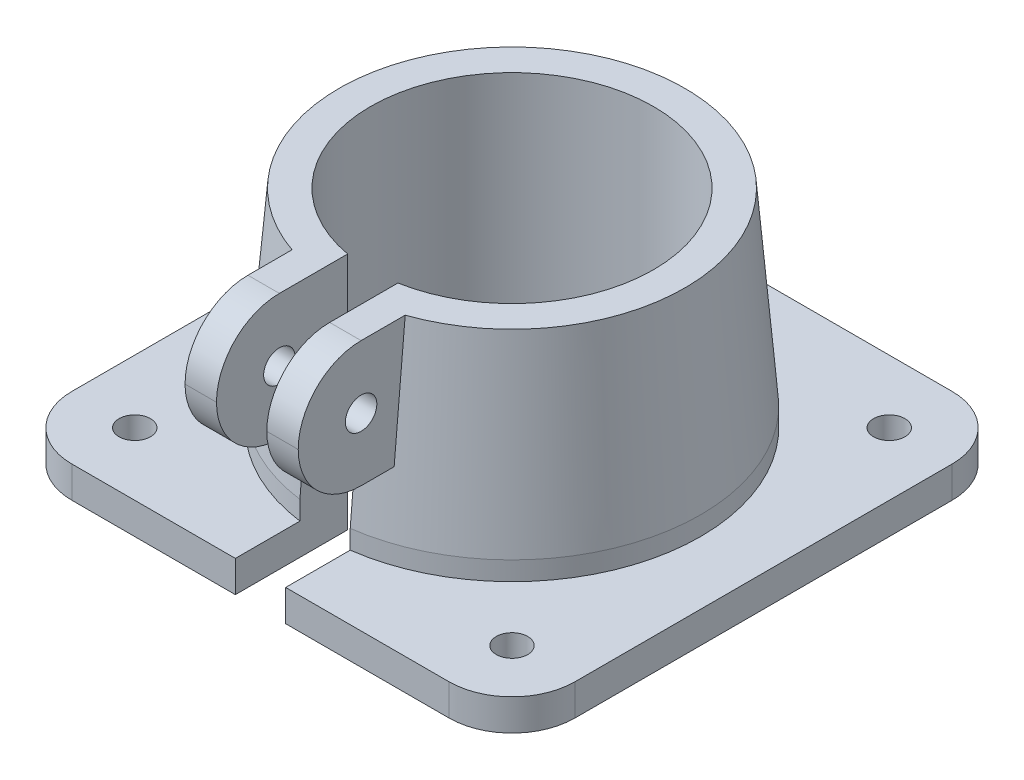
ISO-10303-21;
HEADER;
FILE_DESCRIPTION(('STEP AP214'),'2;1');
FILE_NAME('part.step','',(''),(''),'','','');
FILE_SCHEMA(('AUTOMOTIVE_DESIGN { 1 0 10303 214 1 1 1 1 }'));
ENDSEC;
DATA;
#1=APPLICATION_CONTEXT('core data for automotive mechanical design processes');
#2=APPLICATION_PROTOCOL_DEFINITION('international standard','automotive_design',2000,#1);
#3=PRODUCT_CONTEXT('',#1,'mechanical');
#4=PRODUCT('Part','Part','',(#3));
#5=PRODUCT_RELATED_PRODUCT_CATEGORY('part','',(#4));
#6=PRODUCT_DEFINITION_FORMATION('','',#4);
#7=PRODUCT_DEFINITION_CONTEXT('part definition',#1,'design');
#8=PRODUCT_DEFINITION('design','',#6,#7);
#9=PRODUCT_DEFINITION_SHAPE('','',#8);
#10=(LENGTH_UNIT() NAMED_UNIT(*) SI_UNIT(.MILLI.,.METRE.));
#11=(NAMED_UNIT(*) PLANE_ANGLE_UNIT() SI_UNIT($,.RADIAN.));
#12=(NAMED_UNIT(*) SI_UNIT($,.STERADIAN.) SOLID_ANGLE_UNIT());
#13=UNCERTAINTY_MEASURE_WITH_UNIT(LENGTH_MEASURE(1.E-05),#10,'distance_accuracy_value','');
#14=(GEOMETRIC_REPRESENTATION_CONTEXT(3) GLOBAL_UNCERTAINTY_ASSIGNED_CONTEXT((#13)) GLOBAL_UNIT_ASSIGNED_CONTEXT((#10,
#11,#12)) REPRESENTATION_CONTEXT('',''));
#15=CARTESIAN_POINT('',(0.,0.,0.));
#16=DIRECTION('',(0.,0.,1.));
#17=DIRECTION('',(1.,0.,0.));
#18=AXIS2_PLACEMENT_3D('',#15,#16,#17);
#19=CARTESIAN_POINT('',(0.,0.,0.));
#20=DIRECTION('',(0.,1.,0.));
#21=DIRECTION('',(0.,0.,1.));
#22=AXIS2_PLACEMENT_3D('',#19,#20,#21);
#23=CYLINDRICAL_SURFACE('',#22,22.5);
#24=CARTESIAN_POINT('',(0.,38.,0.));
#25=DIRECTION('',(0.,1.,0.));
#26=DIRECTION('',(0.,0.,1.));
#27=AXIS2_PLACEMENT_3D('',#24,#25,#26);
#28=CIRCLE('',#27,22.5);
#29=CARTESIAN_POINT('',(4.,38.,22.1415898254845));
#30=VERTEX_POINT('',#29);
#31=CARTESIAN_POINT('',(-4.,38.,22.1415898254845));
#32=VERTEX_POINT('',#31);
#33=EDGE_CURVE('E194',#30,#32,#28,.T.);
#34=ORIENTED_EDGE('',*,*,#33,.T.);
#35=DIRECTION('',(0.,1.,0.));
#36=VECTOR('',#35,1.);
#37=CARTESIAN_POINT('',(-4.,0.,22.1415898254845));
#38=LINE('',#37,#36);
#39=CARTESIAN_POINT('',(-4.,0.,22.1415898254845));
#40=VERTEX_POINT('',#39);
#41=EDGE_CURVE('E357',#40,#32,#38,.T.);
#42=ORIENTED_EDGE('',*,*,#41,.F.);
#43=CARTESIAN_POINT('',(0.,0.,0.));
#44=DIRECTION('',(0.,1.,0.));
#45=DIRECTION('',(0.,0.,1.));
#46=AXIS2_PLACEMENT_3D('',#43,#44,#45);
#47=CIRCLE('',#46,22.5);
#48=CARTESIAN_POINT('',(4.,0.,22.1415898254845));
#49=VERTEX_POINT('',#48);
#50=EDGE_CURVE('E210',#49,#40,#47,.T.);
#51=ORIENTED_EDGE('',*,*,#50,.F.);
#52=DIRECTION('',(0.,1.,0.));
#53=VECTOR('',#52,1.);
#54=CARTESIAN_POINT('',(4.,0.,22.1415898254845));
#55=LINE('',#54,#53);
#56=EDGE_CURVE('E206',#49,#30,#55,.T.);
#57=ORIENTED_EDGE('',*,*,#56,.T.);
#58=EDGE_LOOP('',(#34,#42,#51,#57));
#59=FACE_BOUND('',#58,.T.);
#60=ADVANCED_FACE('F40',(#59),#23,.F.);
#61=CARTESIAN_POINT('',(0.,38.,0.));
#62=DIRECTION('',(0.,-1.,0.));
#63=DIRECTION('',(0.,0.,-1.));
#64=AXIS2_PLACEMENT_3D('',#61,#62,#63);
#65=CONICAL_SURFACE('',#64,27.5,0.0831412318884412);
#66=CARTESIAN_POINT('',(9.,73.8331457343378,22.8020068178335));
#67=CARTESIAN_POINT('',(9.,70.0758184808116,23.1386186115361));
#68=CARTESIAN_POINT('',(9.,66.3184031992838,23.4742462495857));
#69=CARTESIAN_POINT('',(9.,58.8034165008538,24.1437469041585));
#70=CARTESIAN_POINT('',(9.,55.04584508396,24.4776199207737));
#71=CARTESIAN_POINT('',(9.,43.7729293566244,25.4769273212473));
#72=CARTESIAN_POINT('',(9.,36.2573801338035,26.1400503631394));
#73=CARTESIAN_POINT('',(9.,20.9795565864973,27.4830753404656));
#74=CARTESIAN_POINT('',(9.,13.2172680091616,28.1628149903969));
#75=CARTESIAN_POINT('',(9.00000000000001,-2.30768196541153,29.518066471215));
#76=CARTESIAN_POINT('',(9.00000000000001,-10.0703433628218,30.1935783001215));
#77=CARTESIAN_POINT('',(9.00000000000001,-17.8331457343378,30.8674604320246));
#78=B_SPLINE_CURVE_WITH_KNOTS('',3,(#66,#67,#68,#69,#70,#71,#72,#73,#74,#75,#76,#77),
.UNSPECIFIED.,.F.,.F.,(4,2,2,2,2,4),(0.,11.3171256263213,22.6342506597728,45.2684903783291,
68.6444710809762,92.0204627325963),.UNSPECIFIED.);
#79=CARTESIAN_POINT('',(9.,38.,25.9855729203726));
#80=VERTEX_POINT('',#79);
#81=CARTESIAN_POINT('',(9.,18.,27.7433675757729));
#82=VERTEX_POINT('',#81);
#83=EDGE_CURVE('E288',#80,#82,#78,.T.);
#84=ORIENTED_EDGE('',*,*,#83,.T.);
#85=CARTESIAN_POINT('',(0.,18.,0.));
#86=DIRECTION('',(0.,1.,0.));
#87=DIRECTION('',(-1.,0.,0.));
#88=AXIS2_PLACEMENT_3D('',#85,#86,#87);
#89=CIRCLE('',#88,29.1666666666667);
#90=CARTESIAN_POINT('',(4.,18.,28.891078976813));
#91=VERTEX_POINT('',#90);
#92=EDGE_CURVE('E285',#82,#91,#89,.F.);
#93=ORIENTED_EDGE('',*,*,#92,.T.);
#94=CARTESIAN_POINT('',(4.,-26.7148496512324,32.6487847033472));
#95=CARTESIAN_POINT('',(4.,-16.6267589983288,31.8018055716135));
#96=CARTESIAN_POINT('',(4.,-6.53870590789701,30.9543784517232));
#97=CARTESIAN_POINT('',(4.,13.6372955511059,29.2582809097083));
#98=CARTESIAN_POINT('',(4.,23.7252439196789,28.4096104876078));
#99=CARTESIAN_POINT('',(4.,40.2968095365762,27.0141760159431));
#100=CARTESIAN_POINT('',(4.,46.780466087042,26.4678787544513));
#101=CARTESIAN_POINT('',(4.,59.7477116331232,25.3744821317756));
#102=CARTESIAN_POINT('',(4.,66.2313006287378,24.8273827705817));
#103=CARTESIAN_POINT('',(4.,72.7148496512324,24.2798098588356));
#104=B_SPLINE_CURVE_WITH_KNOTS('',3,(#94,#95,#96,#97,#98,#99,#100,#101,#102,#103),.UNSPECIFIED.,
.F.,.F.,(4,2,2,2,4),(0.,30.370751129289,60.7415016715958,80.2613937015453,99.7812859739729),.UNSPECIFIED.);
#105=CARTESIAN_POINT('',(4.,8.,29.732137494637));
#106=VERTEX_POINT('',#105);
#107=EDGE_CURVE('E359',#106,#91,#104,.T.);
#108=ORIENTED_EDGE('',*,*,#107,.F.);
#109=CARTESIAN_POINT('',(0.,8.,0.));
#110=DIRECTION('',(0.,1.,0.));
#111=DIRECTION('',(0.,0.,1.));
#112=AXIS2_PLACEMENT_3D('',#109,#110,#111);
#113=CIRCLE('',#112,30.);
#114=CARTESIAN_POINT('',(-4.,8.,29.732137494637));
#115=VERTEX_POINT('',#114);
#116=EDGE_CURVE('E456',#106,#115,#113,.T.);
#117=ORIENTED_EDGE('',*,*,#116,.T.);
#118=CARTESIAN_POINT('',(-4.,-26.7148496512324,32.6487847033472));
#119=CARTESIAN_POINT('',(-4.,-16.6267589983288,31.8018055716135));
#120=CARTESIAN_POINT('',(-4.,-6.53870590789701,30.9543784517232));
#121=CARTESIAN_POINT('',(-4.,13.6372955511059,29.2582809097083));
#122=CARTESIAN_POINT('',(-4.,23.7252439196789,28.4096104876078));
#123=CARTESIAN_POINT('',(-4.,40.2968095365762,27.0141760159431));
#124=CARTESIAN_POINT('',(-4.,46.780466087042,26.4678787544513));
#125=CARTESIAN_POINT('',(-4.,59.7477116331232,25.3744821317756));
#126=CARTESIAN_POINT('',(-4.,66.2313006287378,24.8273827705817));
#127=CARTESIAN_POINT('',(-4.,72.7148496512324,24.2798098588356));
#128=B_SPLINE_CURVE_WITH_KNOTS('',3,(#118,#119,#120,#121,#122,#123,#124,#125,#126,#127),
.UNSPECIFIED.,.F.,.F.,(4,2,2,2,4),(0.,30.370751129289,60.7415016715958,80.2613937015453,
99.7812859739729),.UNSPECIFIED.);
#129=CARTESIAN_POINT('',(-4.,18.,28.891078976813));
#130=VERTEX_POINT('',#129);
#131=EDGE_CURVE('E343',#115,#130,#128,.T.);
#132=ORIENTED_EDGE('',*,*,#131,.T.);
#133=CARTESIAN_POINT('',(0.,18.,0.));
#134=DIRECTION('',(0.,1.,0.));
#135=DIRECTION('',(-1.,0.,0.));
#136=AXIS2_PLACEMENT_3D('',#133,#134,#135);
#137=CIRCLE('',#136,29.1666666666667);
#138=CARTESIAN_POINT('',(-9.,18.,27.7433675757729));
#139=VERTEX_POINT('',#138);
#140=EDGE_CURVE('E337',#130,#139,#137,.F.);
#141=ORIENTED_EDGE('',*,*,#140,.T.);
#142=CARTESIAN_POINT('',(-8.99999999999999,-17.8331457343378,30.8674604320246));
#143=CARTESIAN_POINT('',(-8.99999999999999,-12.903785893805,30.4395694099955));
#144=CARTESIAN_POINT('',(-8.99999999999999,-7.97448497048663,30.0109988361799));
#145=CARTESIAN_POINT('',(-8.99999999999999,1.88398001195845,29.1522826133264));
#146=CARTESIAN_POINT('',(-8.99999999999999,6.81314407107562,28.7221369641796));
#147=CARTESIAN_POINT('',(-9.,16.6713123568272,27.8600549629338));
#148=CARTESIAN_POINT('',(-9.,21.600316583565,27.4281186120181));
#149=CARTESIAN_POINT('',(-9.,31.4581434970061,26.5621806032858));
#150=CARTESIAN_POINT('',(-9.,36.3869661837143,26.1281789455263));
#151=CARTESIAN_POINT('',(-9.,46.7355495926887,25.2144231641757));
#152=CARTESIAN_POINT('',(-9.,52.1552882958359,24.7344195120245));
#153=CARTESIAN_POINT('',(-9.00000000000001,62.9944600270205,23.7709521125825));
#154=CARTESIAN_POINT('',(-9.00000000000001,68.4138930549483,23.2874883640591));
#155=CARTESIAN_POINT('',(-9.00000000000001,73.8331457343378,22.8020068178335));
#156=B_SPLINE_CURVE_WITH_KNOTS('',3,(#142,#143,#144,#145,#146,#147,#148,#149,#150,#151,#152,
#153,#154,#155),.UNSPECIFIED.,.F.,.F.,(4,2,2,2,2,2,4),(0.,14.8436893717152,29.687379769946,
44.5310603606625,59.374740539818,75.6975989256614,92.0204631266317),.UNSPECIFIED.);
#157=CARTESIAN_POINT('',(-9.,38.,25.9855729203726));
#158=VERTEX_POINT('',#157);
#159=EDGE_CURVE('E328',#139,#158,#156,.T.);
#160=ORIENTED_EDGE('',*,*,#159,.T.);
#161=CARTESIAN_POINT('',(0.,38.,0.));
#162=DIRECTION('',(0.,1.,0.));
#163=DIRECTION('',(0.,0.,1.));
#164=AXIS2_PLACEMENT_3D('',#161,#162,#163);
#165=CIRCLE('',#164,27.5);
#166=EDGE_CURVE('E205',#80,#158,#165,.T.);
#167=ORIENTED_EDGE('',*,*,#166,.F.);
#168=EDGE_LOOP('',(#84,#93,#108,#117,#132,#141,#160,#167));
#169=FACE_BOUND('',#168,.T.);
#170=ADVANCED_FACE('F299',(#169),#65,.T.);
#171=CARTESIAN_POINT('',(30.,5.,40.));
#172=DIRECTION('',(0.,0.,-1.));
#173=DIRECTION('',(-1.,0.,0.));
#174=AXIS2_PLACEMENT_3D('',#171,#172,#173);
#175=PLANE('',#174);
#176=DIRECTION('',(0.,-1.,0.));
#177=VECTOR('',#176,1.);
#178=CARTESIAN_POINT('',(-4.,38.,40.));
#179=LINE('',#178,#177);
#180=CARTESIAN_POINT('',(-4.,5.,40.));
#181=VERTEX_POINT('',#180);
#182=CARTESIAN_POINT('',(-4.,0.,40.));
#183=VERTEX_POINT('',#182);
#184=EDGE_CURVE('E336',#181,#183,#179,.T.);
#185=ORIENTED_EDGE('',*,*,#184,.F.);
#186=DIRECTION('',(1.,0.,0.));
#187=VECTOR('',#186,1.);
#188=CARTESIAN_POINT('',(30.,5.,40.));
#189=LINE('',#188,#187);
#190=CARTESIAN_POINT('',(-30.,5.,40.));
#191=VERTEX_POINT('',#190);
#192=EDGE_CURVE('E486',#191,#181,#189,.T.);
#193=ORIENTED_EDGE('',*,*,#192,.F.);
#194=DIRECTION('',(0.,-1.,0.));
#195=VECTOR('',#194,1.);
#196=CARTESIAN_POINT('',(-30.,5.,40.));
#197=LINE('',#196,#195);
#198=CARTESIAN_POINT('',(-30.,0.,40.));
#199=VERTEX_POINT('',#198);
#200=EDGE_CURVE('E506',#191,#199,#197,.T.);
#201=ORIENTED_EDGE('',*,*,#200,.T.);
#202=DIRECTION('',(1.,0.,0.));
#203=VECTOR('',#202,1.);
#204=CARTESIAN_POINT('',(30.,0.,40.));
#205=LINE('',#204,#203);
#206=EDGE_CURVE('E473',#199,#183,#205,.T.);
#207=ORIENTED_EDGE('',*,*,#206,.T.);
#208=EDGE_LOOP('',(#185,#193,#201,#207));
#209=FACE_BOUND('',#208,.T.);
#210=ADVANCED_FACE('F379',(#209),#175,.F.);
#211=CARTESIAN_POINT('',(30.,5.,30.));
#212=DIRECTION('',(0.,-1.,0.));
#213=DIRECTION('',(0.,0.,-1.));
#214=AXIS2_PLACEMENT_3D('',#211,#212,#213);
#215=CYLINDRICAL_SURFACE('',#214,10.);
#216=CARTESIAN_POINT('',(30.,0.,30.));
#217=DIRECTION('',(0.,1.,0.));
#218=DIRECTION('',(0.,0.,1.));
#219=AXIS2_PLACEMENT_3D('',#216,#217,#218);
#220=CIRCLE('',#219,10.);
#221=CARTESIAN_POINT('',(30.,0.,40.));
#222=VERTEX_POINT('',#221);
#223=CARTESIAN_POINT('',(40.,0.,30.));
#224=VERTEX_POINT('',#223);
#225=EDGE_CURVE('E458',#222,#224,#220,.T.);
#226=ORIENTED_EDGE('',*,*,#225,.T.);
#227=DIRECTION('',(0.,-1.,0.));
#228=VECTOR('',#227,1.);
#229=CARTESIAN_POINT('',(40.,5.,30.));
#230=LINE('',#229,#228);
#231=CARTESIAN_POINT('',(40.,5.,30.));
#232=VERTEX_POINT('',#231);
#233=EDGE_CURVE('E468',#232,#224,#230,.T.);
#234=ORIENTED_EDGE('',*,*,#233,.F.);
#235=CARTESIAN_POINT('',(30.,5.,30.));
#236=DIRECTION('',(0.,1.,0.));
#237=DIRECTION('',(0.,0.,1.));
#238=AXIS2_PLACEMENT_3D('',#235,#236,#237);
#239=CIRCLE('',#238,10.);
#240=CARTESIAN_POINT('',(30.,5.,40.));
#241=VERTEX_POINT('',#240);
#242=EDGE_CURVE('E469',#241,#232,#239,.T.);
#243=ORIENTED_EDGE('',*,*,#242,.F.);
#244=DIRECTION('',(0.,-1.,0.));
#245=VECTOR('',#244,1.);
#246=CARTESIAN_POINT('',(30.,5.,40.));
#247=LINE('',#246,#245);
#248=EDGE_CURVE('E488',#241,#222,#247,.T.);
#249=ORIENTED_EDGE('',*,*,#248,.T.);
#250=EDGE_LOOP('',(#226,#234,#243,#249));
#251=FACE_BOUND('',#250,.T.);
#252=ADVANCED_FACE('F422',(#251),#215,.T.);
#253=CARTESIAN_POINT('',(40.,5.,30.));
#254=DIRECTION('',(-1.,0.,0.));
#255=DIRECTION('',(0.,0.,1.));
#256=AXIS2_PLACEMENT_3D('',#253,#254,#255);
#257=PLANE('',#256);
#258=DIRECTION('',(0.,0.,-1.));
#259=VECTOR('',#258,1.);
#260=CARTESIAN_POINT('',(40.,0.,30.));
#261=LINE('',#260,#259);
#262=CARTESIAN_POINT('',(40.,0.,-30.));
#263=VERTEX_POINT('',#262);
#264=EDGE_CURVE('E461',#224,#263,#261,.T.);
#265=ORIENTED_EDGE('',*,*,#264,.T.);
#266=DIRECTION('',(0.,-1.,0.));
#267=VECTOR('',#266,1.);
#268=CARTESIAN_POINT('',(40.,5.,-30.));
#269=LINE('',#268,#267);
#270=CARTESIAN_POINT('',(40.,5.,-30.));
#271=VERTEX_POINT('',#270);
#272=EDGE_CURVE('E521',#271,#263,#269,.T.);
#273=ORIENTED_EDGE('',*,*,#272,.F.);
#274=DIRECTION('',(0.,0.,-1.));
#275=VECTOR('',#274,1.);
#276=CARTESIAN_POINT('',(40.,5.,30.));
#277=LINE('',#276,#275);
#278=EDGE_CURVE('E472',#232,#271,#277,.T.);
#279=ORIENTED_EDGE('',*,*,#278,.F.);
#280=ORIENTED_EDGE('',*,*,#233,.T.);
#281=EDGE_LOOP('',(#265,#273,#279,#280));
#282=FACE_BOUND('',#281,.T.);
#283=ADVANCED_FACE('F418',(#282),#257,.F.);
#284=CARTESIAN_POINT('',(30.,5.,-30.));
#285=DIRECTION('',(0.,-1.,0.));
#286=DIRECTION('',(0.,0.,-1.));
#287=AXIS2_PLACEMENT_3D('',#284,#285,#286);
#288=CYLINDRICAL_SURFACE('',#287,10.);
#289=CARTESIAN_POINT('',(30.,0.,-30.));
#290=DIRECTION('',(0.,1.,0.));
#291=DIRECTION('',(0.,0.,1.));
#292=AXIS2_PLACEMENT_3D('',#289,#290,#291);
#293=CIRCLE('',#292,10.);
#294=CARTESIAN_POINT('',(30.,0.,-40.));
#295=VERTEX_POINT('',#294);
#296=EDGE_CURVE('E491',#263,#295,#293,.T.);
#297=ORIENTED_EDGE('',*,*,#296,.T.);
#298=DIRECTION('',(0.,-1.,0.));
#299=VECTOR('',#298,1.);
#300=CARTESIAN_POINT('',(30.,5.,-40.));
#301=LINE('',#300,#299);
#302=CARTESIAN_POINT('',(30.,5.,-40.));
#303=VERTEX_POINT('',#302);
#304=EDGE_CURVE('E518',#303,#295,#301,.T.);
#305=ORIENTED_EDGE('',*,*,#304,.F.);
#306=CARTESIAN_POINT('',(30.,5.,-30.));
#307=DIRECTION('',(0.,1.,0.));
#308=DIRECTION('',(0.,0.,1.));
#309=AXIS2_PLACEMENT_3D('',#306,#307,#308);
#310=CIRCLE('',#309,10.);
#311=EDGE_CURVE('E475',#271,#303,#310,.T.);
#312=ORIENTED_EDGE('',*,*,#311,.F.);
#313=ORIENTED_EDGE('',*,*,#272,.T.);
#314=EDGE_LOOP('',(#297,#305,#312,#313));
#315=FACE_BOUND('',#314,.T.);
#316=ADVANCED_FACE('F414',(#315),#288,.T.);
#317=CARTESIAN_POINT('',(30.,5.,-40.));
#318=DIRECTION('',(0.,0.,1.));
#319=DIRECTION('',(1.,0.,0.));
#320=AXIS2_PLACEMENT_3D('',#317,#318,#319);
#321=PLANE('',#320);
#322=DIRECTION('',(-1.,0.,0.));
#323=VECTOR('',#322,1.);
#324=CARTESIAN_POINT('',(30.,0.,-40.));
#325=LINE('',#324,#323);
#326=CARTESIAN_POINT('',(-30.,0.,-40.));
#327=VERTEX_POINT('',#326);
#328=EDGE_CURVE('E493',#295,#327,#325,.T.);
#329=ORIENTED_EDGE('',*,*,#328,.T.);
#330=DIRECTION('',(0.,-1.,0.));
#331=VECTOR('',#330,1.);
#332=CARTESIAN_POINT('',(-30.,5.,-40.));
#333=LINE('',#332,#331);
#334=CARTESIAN_POINT('',(-30.,5.,-40.));
#335=VERTEX_POINT('',#334);
#336=EDGE_CURVE('E515',#335,#327,#333,.T.);
#337=ORIENTED_EDGE('',*,*,#336,.F.);
#338=DIRECTION('',(-1.,0.,0.));
#339=VECTOR('',#338,1.);
#340=CARTESIAN_POINT('',(30.,5.,-40.));
#341=LINE('',#340,#339);
#342=EDGE_CURVE('E477',#303,#335,#341,.T.);
#343=ORIENTED_EDGE('',*,*,#342,.F.);
#344=ORIENTED_EDGE('',*,*,#304,.T.);
#345=EDGE_LOOP('',(#329,#337,#343,#344));
#346=FACE_BOUND('',#345,.T.);
#347=ADVANCED_FACE('F410',(#346),#321,.F.);
#348=CARTESIAN_POINT('',(-30.,5.,-30.));
#349=DIRECTION('',(0.,-1.,0.));
#350=DIRECTION('',(0.,0.,-1.));
#351=AXIS2_PLACEMENT_3D('',#348,#349,#350);
#352=CYLINDRICAL_SURFACE('',#351,10.);
#353=CARTESIAN_POINT('',(-30.,0.,-30.));
#354=DIRECTION('',(0.,1.,0.));
#355=DIRECTION('',(0.,0.,-1.));
#356=AXIS2_PLACEMENT_3D('',#353,#354,#355);
#357=CIRCLE('',#356,10.);
#358=CARTESIAN_POINT('',(-40.,0.,-30.));
#359=VERTEX_POINT('',#358);
#360=EDGE_CURVE('E495',#327,#359,#357,.T.);
#361=ORIENTED_EDGE('',*,*,#360,.T.);
#362=DIRECTION('',(0.,-1.,0.));
#363=VECTOR('',#362,1.);
#364=CARTESIAN_POINT('',(-40.,5.,-30.));
#365=LINE('',#364,#363);
#366=CARTESIAN_POINT('',(-40.,5.,-30.));
#367=VERTEX_POINT('',#366);
#368=EDGE_CURVE('E512',#367,#359,#365,.T.);
#369=ORIENTED_EDGE('',*,*,#368,.F.);
#370=CARTESIAN_POINT('',(-30.,5.,-30.));
#371=DIRECTION('',(0.,1.,0.));
#372=DIRECTION('',(0.,0.,-1.));
#373=AXIS2_PLACEMENT_3D('',#370,#371,#372);
#374=CIRCLE('',#373,10.);
#375=EDGE_CURVE('E479',#335,#367,#374,.T.);
#376=ORIENTED_EDGE('',*,*,#375,.F.);
#377=ORIENTED_EDGE('',*,*,#336,.T.);
#378=EDGE_LOOP('',(#361,#369,#376,#377));
#379=FACE_BOUND('',#378,.T.);
#380=ADVANCED_FACE('F406',(#379),#352,.T.);
#381=CARTESIAN_POINT('',(-40.,5.,30.));
#382=DIRECTION('',(1.,0.,0.));
#383=DIRECTION('',(0.,0.,-1.));
#384=AXIS2_PLACEMENT_3D('',#381,#382,#383);
#385=PLANE('',#384);
#386=DIRECTION('',(0.,0.,1.));
#387=VECTOR('',#386,1.);
#388=CARTESIAN_POINT('',(-40.,0.,30.));
#389=LINE('',#388,#387);
#390=CARTESIAN_POINT('',(-40.,0.,30.));
#391=VERTEX_POINT('',#390);
#392=EDGE_CURVE('E497',#359,#391,#389,.T.);
#393=ORIENTED_EDGE('',*,*,#392,.T.);
#394=DIRECTION('',(0.,-1.,0.));
#395=VECTOR('',#394,1.);
#396=CARTESIAN_POINT('',(-40.,5.,30.));
#397=LINE('',#396,#395);
#398=CARTESIAN_POINT('',(-40.,5.,30.));
#399=VERTEX_POINT('',#398);
#400=EDGE_CURVE('E509',#399,#391,#397,.T.);
#401=ORIENTED_EDGE('',*,*,#400,.F.);
#402=DIRECTION('',(0.,0.,1.));
#403=VECTOR('',#402,1.);
#404=CARTESIAN_POINT('',(-40.,5.,30.));
#405=LINE('',#404,#403);
#406=EDGE_CURVE('E481',#367,#399,#405,.T.);
#407=ORIENTED_EDGE('',*,*,#406,.F.);
#408=ORIENTED_EDGE('',*,*,#368,.T.);
#409=EDGE_LOOP('',(#393,#401,#407,#408));
#410=FACE_BOUND('',#409,.T.);
#411=ADVANCED_FACE('F402',(#410),#385,.F.);
#412=CARTESIAN_POINT('',(-30.,5.,30.));
#413=DIRECTION('',(0.,-1.,0.));
#414=DIRECTION('',(0.,0.,-1.));
#415=AXIS2_PLACEMENT_3D('',#412,#413,#414);
#416=CYLINDRICAL_SURFACE('',#415,10.);
#417=CARTESIAN_POINT('',(-30.,0.,30.));
#418=DIRECTION('',(0.,1.,0.));
#419=DIRECTION('',(0.,0.,-1.));
#420=AXIS2_PLACEMENT_3D('',#417,#418,#419);
#421=CIRCLE('',#420,10.);
#422=EDGE_CURVE('E499',#391,#199,#421,.T.);
#423=ORIENTED_EDGE('',*,*,#422,.T.);
#424=ORIENTED_EDGE('',*,*,#200,.F.);
#425=CARTESIAN_POINT('',(-30.,5.,30.));
#426=DIRECTION('',(0.,1.,0.));
#427=DIRECTION('',(0.,0.,-1.));
#428=AXIS2_PLACEMENT_3D('',#425,#426,#427);
#429=CIRCLE('',#428,10.);
#430=EDGE_CURVE('E483',#399,#191,#429,.T.);
#431=ORIENTED_EDGE('',*,*,#430,.F.);
#432=ORIENTED_EDGE('',*,*,#400,.T.);
#433=EDGE_LOOP('',(#423,#424,#431,#432));
#434=FACE_BOUND('',#433,.T.);
#435=ADVANCED_FACE('F398',(#434),#416,.T.);
#436=CARTESIAN_POINT('',(4.,5.,40.));
#437=VERTEX_POINT('',#436);
#438=EDGE_CURVE('E485',#437,#241,#189,.T.);
#439=ORIENTED_EDGE('',*,*,#438,.F.);
#440=DIRECTION('',(0.,-1.,0.));
#441=VECTOR('',#440,1.);
#442=CARTESIAN_POINT('',(4.,38.,40.));
#443=LINE('',#442,#441);
#444=CARTESIAN_POINT('',(4.,0.,40.));
#445=VERTEX_POINT('',#444);
#446=EDGE_CURVE('E340',#437,#445,#443,.T.);
#447=ORIENTED_EDGE('',*,*,#446,.T.);
#448=EDGE_CURVE('E501',#445,#222,#205,.T.);
#449=ORIENTED_EDGE('',*,*,#448,.T.);
#450=ORIENTED_EDGE('',*,*,#248,.F.);
#451=EDGE_LOOP('',(#439,#447,#449,#450));
#452=FACE_BOUND('',#451,.T.);
#453=ADVANCED_FACE('F392',(#452),#175,.F.);
#454=CARTESIAN_POINT('',(30.,5.,30.));
#455=DIRECTION('',(0.,1.,0.));
#456=DIRECTION('',(0.,0.,1.));
#457=AXIS2_PLACEMENT_3D('',#454,#455,#456);
#458=PLANE('',#457);
#459=CARTESIAN_POINT('',(-30.,5.,30.));
#460=DIRECTION('',(0.,1.,0.));
#461=DIRECTION('',(0.,0.,1.));
#462=AXIS2_PLACEMENT_3D('',#459,#460,#461);
#463=CIRCLE('',#462,2.5);
#464=CARTESIAN_POINT('',(-30.,5.,32.5));
#465=VERTEX_POINT('',#464);
#466=EDGE_CURVE('E744',#465,#465,#463,.T.);
#467=ORIENTED_EDGE('',*,*,#466,.F.);
#468=EDGE_LOOP('',(#467));
#469=FACE_BOUND('',#468,.T.);
#470=CARTESIAN_POINT('',(30.,5.,-30.));
#471=DIRECTION('',(0.,1.,0.));
#472=DIRECTION('',(0.,0.,1.));
#473=AXIS2_PLACEMENT_3D('',#470,#471,#472);
#474=CIRCLE('',#473,2.5);
#475=CARTESIAN_POINT('',(30.,5.,-27.5));
#476=VERTEX_POINT('',#475);
#477=EDGE_CURVE('E745',#476,#476,#474,.T.);
#478=ORIENTED_EDGE('',*,*,#477,.F.);
#479=EDGE_LOOP('',(#478));
#480=FACE_BOUND('',#479,.T.);
#481=CARTESIAN_POINT('',(-30.,5.,-30.));
#482=DIRECTION('',(0.,1.,0.));
#483=DIRECTION('',(0.,0.,1.));
#484=AXIS2_PLACEMENT_3D('',#481,#482,#483);
#485=CIRCLE('',#484,2.5);
#486=CARTESIAN_POINT('',(-30.,5.,-27.5));
#487=VERTEX_POINT('',#486);
#488=EDGE_CURVE('E749',#487,#487,#485,.T.);
#489=ORIENTED_EDGE('',*,*,#488,.F.);
#490=EDGE_LOOP('',(#489));
#491=FACE_BOUND('',#490,.T.);
#492=CARTESIAN_POINT('',(30.,5.,30.));
#493=DIRECTION('',(0.,1.,0.));
#494=DIRECTION('',(0.,0.,1.));
#495=AXIS2_PLACEMENT_3D('',#492,#493,#494);
#496=CIRCLE('',#495,2.5);
#497=CARTESIAN_POINT('',(30.,5.,32.5));
#498=VERTEX_POINT('',#497);
#499=EDGE_CURVE('E255',#498,#498,#496,.T.);
#500=ORIENTED_EDGE('',*,*,#499,.F.);
#501=EDGE_LOOP('',(#500));
#502=FACE_BOUND('',#501,.T.);
#503=DIRECTION('',(0.,0.,-1.));
#504=VECTOR('',#503,1.);
#505=CARTESIAN_POINT('',(4.,5.,30.));
#506=LINE('',#505,#504);
#507=CARTESIAN_POINT('',(4.,5.,29.732137494637));
#508=VERTEX_POINT('',#507);
#509=EDGE_CURVE('E544',#437,#508,#506,.T.);
#510=ORIENTED_EDGE('',*,*,#509,.F.);
#511=ORIENTED_EDGE('',*,*,#438,.T.);
#512=ORIENTED_EDGE('',*,*,#242,.T.);
#513=ORIENTED_EDGE('',*,*,#278,.T.);
#514=ORIENTED_EDGE('',*,*,#311,.T.);
#515=ORIENTED_EDGE('',*,*,#342,.T.);
#516=ORIENTED_EDGE('',*,*,#375,.T.);
#517=ORIENTED_EDGE('',*,*,#406,.T.);
#518=ORIENTED_EDGE('',*,*,#430,.T.);
#519=ORIENTED_EDGE('',*,*,#192,.T.);
#520=DIRECTION('',(0.,0.,-1.));
#521=VECTOR('',#520,1.);
#522=CARTESIAN_POINT('',(-4.,5.,30.));
#523=LINE('',#522,#521);
#524=CARTESIAN_POINT('',(-4.,5.,29.732137494637));
#525=VERTEX_POINT('',#524);
#526=EDGE_CURVE('E352',#181,#525,#523,.T.);
#527=ORIENTED_EDGE('',*,*,#526,.T.);
#528=CARTESIAN_POINT('',(0.,5.,0.));
#529=DIRECTION('',(0.,1.,0.));
#530=DIRECTION('',(0.,0.,1.));
#531=AXIS2_PLACEMENT_3D('',#528,#529,#530);
#532=CIRCLE('',#531,30.);
#533=EDGE_CURVE('E222',#508,#525,#532,.T.);
#534=ORIENTED_EDGE('',*,*,#533,.F.);
#535=EDGE_LOOP('',(#510,#511,#512,#513,#514,#515,#516,#517,#518,#519,#527,#534));
#536=FACE_BOUND('',#535,.T.);
#537=ADVANCED_FACE('F389',(#469,#480,#491,#502,#536),#458,.T.);
#538=CARTESIAN_POINT('',(30.,0.,30.));
#539=DIRECTION('',(0.,1.,0.));
#540=DIRECTION('',(0.,0.,1.));
#541=AXIS2_PLACEMENT_3D('',#538,#539,#540);
#542=PLANE('',#541);
#543=CARTESIAN_POINT('',(-30.,0.,30.));
#544=DIRECTION('',(0.,1.,0.));
#545=DIRECTION('',(0.,0.,1.));
#546=AXIS2_PLACEMENT_3D('',#543,#544,#545);
#547=CIRCLE('',#546,2.5);
#548=CARTESIAN_POINT('',(-30.,0.,32.5));
#549=VERTEX_POINT('',#548);
#550=EDGE_CURVE('E44',#549,#549,#547,.T.);
#551=ORIENTED_EDGE('',*,*,#550,.T.);
#552=EDGE_LOOP('',(#551));
#553=FACE_BOUND('',#552,.T.);
#554=CARTESIAN_POINT('',(30.,0.,-30.));
#555=DIRECTION('',(0.,1.,0.));
#556=DIRECTION('',(0.,0.,1.));
#557=AXIS2_PLACEMENT_3D('',#554,#555,#556);
#558=CIRCLE('',#557,2.5);
#559=CARTESIAN_POINT('',(30.,0.,-27.5));
#560=VERTEX_POINT('',#559);
#561=EDGE_CURVE('E257',#560,#560,#558,.T.);
#562=ORIENTED_EDGE('',*,*,#561,.T.);
#563=EDGE_LOOP('',(#562));
#564=FACE_BOUND('',#563,.T.);
#565=CARTESIAN_POINT('',(-30.,0.,-30.));
#566=DIRECTION('',(0.,1.,0.));
#567=DIRECTION('',(0.,0.,1.));
#568=AXIS2_PLACEMENT_3D('',#565,#566,#567);
#569=CIRCLE('',#568,2.5);
#570=CARTESIAN_POINT('',(-30.,0.,-27.5));
#571=VERTEX_POINT('',#570);
#572=EDGE_CURVE('E254',#571,#571,#569,.T.);
#573=ORIENTED_EDGE('',*,*,#572,.T.);
#574=EDGE_LOOP('',(#573));
#575=FACE_BOUND('',#574,.T.);
#576=CARTESIAN_POINT('',(30.,0.,30.));
#577=DIRECTION('',(0.,1.,0.));
#578=DIRECTION('',(0.,0.,1.));
#579=AXIS2_PLACEMENT_3D('',#576,#577,#578);
#580=CIRCLE('',#579,2.5);
#581=CARTESIAN_POINT('',(30.,0.,32.5));
#582=VERTEX_POINT('',#581);
#583=EDGE_CURVE('E251',#582,#582,#580,.T.);
#584=ORIENTED_EDGE('',*,*,#583,.T.);
#585=EDGE_LOOP('',(#584));
#586=FACE_BOUND('',#585,.T.);
#587=ORIENTED_EDGE('',*,*,#448,.F.);
#588=DIRECTION('',(0.,0.,-1.));
#589=VECTOR('',#588,1.);
#590=CARTESIAN_POINT('',(4.,0.,30.));
#591=LINE('',#590,#589);
#592=EDGE_CURVE('E213',#445,#49,#591,.T.);
#593=ORIENTED_EDGE('',*,*,#592,.T.);
#594=ORIENTED_EDGE('',*,*,#50,.T.);
#595=DIRECTION('',(0.,0.,-1.));
#596=VECTOR('',#595,1.);
#597=CARTESIAN_POINT('',(-4.,0.,30.));
#598=LINE('',#597,#596);
#599=EDGE_CURVE('E355',#183,#40,#598,.T.);
#600=ORIENTED_EDGE('',*,*,#599,.F.);
#601=ORIENTED_EDGE('',*,*,#206,.F.);
#602=ORIENTED_EDGE('',*,*,#422,.F.);
#603=ORIENTED_EDGE('',*,*,#392,.F.);
#604=ORIENTED_EDGE('',*,*,#360,.F.);
#605=ORIENTED_EDGE('',*,*,#328,.F.);
#606=ORIENTED_EDGE('',*,*,#296,.F.);
#607=ORIENTED_EDGE('',*,*,#264,.F.);
#608=ORIENTED_EDGE('',*,*,#225,.F.);
#609=EDGE_LOOP('',(#587,#593,#594,#600,#601,#602,#603,#604,#605,#606,#607,#608));
#610=FACE_BOUND('',#609,.T.);
#611=ADVANCED_FACE('F387',(#553,#564,#575,#586,#610),#542,.F.);
#612=CARTESIAN_POINT('',(0.,8.,0.));
#613=DIRECTION('',(0.,-1.,0.));
#614=DIRECTION('',(0.,0.,-1.));
#615=AXIS2_PLACEMENT_3D('',#612,#613,#614);
#616=CYLINDRICAL_SURFACE('',#615,30.);
#617=ORIENTED_EDGE('',*,*,#116,.F.);
#618=DIRECTION('',(0.,-1.,0.));
#619=VECTOR('',#618,1.);
#620=CARTESIAN_POINT('',(4.,8.,29.732137494637));
#621=LINE('',#620,#619);
#622=EDGE_CURVE('E366',#106,#508,#621,.T.);
#623=ORIENTED_EDGE('',*,*,#622,.T.);
#624=ORIENTED_EDGE('',*,*,#533,.T.);
#625=DIRECTION('',(0.,-1.,0.));
#626=VECTOR('',#625,1.);
#627=CARTESIAN_POINT('',(-4.,8.,29.732137494637));
#628=LINE('',#627,#626);
#629=EDGE_CURVE('E350',#115,#525,#628,.T.);
#630=ORIENTED_EDGE('',*,*,#629,.F.);
#631=EDGE_LOOP('',(#617,#623,#624,#630));
#632=FACE_BOUND('',#631,.T.);
#633=ADVANCED_FACE('F384',(#632),#616,.T.);
#634=CARTESIAN_POINT('',(0.,38.,0.));
#635=DIRECTION('',(0.,1.,0.));
#636=DIRECTION('',(0.,0.,1.));
#637=AXIS2_PLACEMENT_3D('',#634,#635,#636);
#638=PLANE('',#637);
#639=ORIENTED_EDGE('',*,*,#33,.F.);
#640=DIRECTION('',(0.,0.,-1.));
#641=VECTOR('',#640,1.);
#642=CARTESIAN_POINT('',(4.,38.,0.));
#643=LINE('',#642,#641);
#644=CARTESIAN_POINT('',(4.,38.,33.));
#645=VERTEX_POINT('',#644);
#646=EDGE_CURVE('E198',#645,#30,#643,.T.);
#647=ORIENTED_EDGE('',*,*,#646,.F.);
#648=DIRECTION('',(-1.,0.,0.));
#649=VECTOR('',#648,1.);
#650=CARTESIAN_POINT('',(0.,38.,33.));
#651=LINE('',#650,#649);
#652=CARTESIAN_POINT('',(9.,38.,33.));
#653=VERTEX_POINT('',#652);
#654=EDGE_CURVE('E12',#645,#653,#651,.F.);
#655=ORIENTED_EDGE('',*,*,#654,.T.);
#656=DIRECTION('',(0.,0.,-1.));
#657=VECTOR('',#656,1.);
#658=CARTESIAN_POINT('',(9.,38.,43.));
#659=LINE('',#658,#657);
#660=EDGE_CURVE('E246',#653,#80,#659,.T.);
#661=ORIENTED_EDGE('',*,*,#660,.T.);
#662=ORIENTED_EDGE('',*,*,#166,.T.);
#663=DIRECTION('',(0.,0.,-1.));
#664=VECTOR('',#663,1.);
#665=CARTESIAN_POINT('',(-9.,38.,43.));
#666=LINE('',#665,#664);
#667=CARTESIAN_POINT('',(-9.,38.,33.));
#668=VERTEX_POINT('',#667);
#669=EDGE_CURVE('E450',#668,#158,#666,.T.);
#670=ORIENTED_EDGE('',*,*,#669,.F.);
#671=DIRECTION('',(-1.,0.,0.));
#672=VECTOR('',#671,1.);
#673=CARTESIAN_POINT('',(-4.,38.,33.));
#674=LINE('',#673,#672);
#675=CARTESIAN_POINT('',(-4.,38.,33.));
#676=VERTEX_POINT('',#675);
#677=EDGE_CURVE('E49',#668,#676,#674,.F.);
#678=ORIENTED_EDGE('',*,*,#677,.T.);
#679=DIRECTION('',(0.,0.,-1.));
#680=VECTOR('',#679,1.);
#681=CARTESIAN_POINT('',(-4.,38.,0.));
#682=LINE('',#681,#680);
#683=EDGE_CURVE('E201',#676,#32,#682,.T.);
#684=ORIENTED_EDGE('',*,*,#683,.T.);
#685=EDGE_LOOP('',(#639,#647,#655,#661,#662,#670,#678,#684));
#686=FACE_BOUND('',#685,.T.);
#687=ADVANCED_FACE('F196',(#686),#638,.T.);
#688=CARTESIAN_POINT('',(-4.,38.,12.5326905217829));
#689=DIRECTION('',(1.,0.,0.));
#690=DIRECTION('',(0.,0.,-1.));
#691=AXIS2_PLACEMENT_3D('',#688,#689,#690);
#692=PLANE('',#691);
#693=ORIENTED_EDGE('',*,*,#41,.T.);
#694=ORIENTED_EDGE('',*,*,#683,.F.);
#695=CARTESIAN_POINT('',(-4.,28.,33.));
#696=DIRECTION('',(1.,0.,0.));
#697=DIRECTION('',(0.,0.,-1.));
#698=AXIS2_PLACEMENT_3D('',#695,#696,#697);
#699=CIRCLE('',#698,10.);
#700=CARTESIAN_POINT('',(-4.,28.,43.));
#701=VERTEX_POINT('',#700);
#702=EDGE_CURVE('E233',#676,#701,#699,.T.);
#703=ORIENTED_EDGE('',*,*,#702,.T.);
#704=CARTESIAN_POINT('',(-4.,28.,33.));
#705=DIRECTION('',(1.,0.,0.));
#706=DIRECTION('',(0.,0.,-1.));
#707=AXIS2_PLACEMENT_3D('',#704,#705,#706);
#708=CIRCLE('',#707,10.);
#709=CARTESIAN_POINT('',(-4.,18.,33.));
#710=VERTEX_POINT('',#709);
#711=EDGE_CURVE('E235',#701,#710,#708,.T.);
#712=ORIENTED_EDGE('',*,*,#711,.T.);
#713=DIRECTION('',(0.,0.,-1.));
#714=VECTOR('',#713,1.);
#715=CARTESIAN_POINT('',(-4.,18.,43.));
#716=LINE('',#715,#714);
#717=EDGE_CURVE('E297',#710,#130,#716,.T.);
#718=ORIENTED_EDGE('',*,*,#717,.T.);
#719=ORIENTED_EDGE('',*,*,#131,.F.);
#720=ORIENTED_EDGE('',*,*,#629,.T.);
#721=ORIENTED_EDGE('',*,*,#526,.F.);
#722=ORIENTED_EDGE('',*,*,#184,.T.);
#723=ORIENTED_EDGE('',*,*,#599,.T.);
#724=EDGE_LOOP('',(#693,#694,#703,#712,#718,#719,#720,#721,#722,#723));
#725=FACE_BOUND('',#724,.T.);
#726=CARTESIAN_POINT('',(-4.,28.,33.));
#727=DIRECTION('',(1.,0.,0.));
#728=DIRECTION('',(0.,0.,-1.));
#729=AXIS2_PLACEMENT_3D('',#726,#727,#728);
#730=CIRCLE('',#729,2.5);
#731=CARTESIAN_POINT('',(-4.,28.,30.5));
#732=VERTEX_POINT('',#731);
#733=EDGE_CURVE('E250',#732,#732,#730,.T.);
#734=ORIENTED_EDGE('',*,*,#733,.F.);
#735=EDGE_LOOP('',(#734));
#736=FACE_BOUND('',#735,.T.);
#737=ADVANCED_FACE('F325',(#725,#736),#692,.T.);
#738=CARTESIAN_POINT('',(4.,38.,12.5326905217829));
#739=DIRECTION('',(1.,0.,0.));
#740=DIRECTION('',(0.,0.,-1.));
#741=AXIS2_PLACEMENT_3D('',#738,#739,#740);
#742=PLANE('',#741);
#743=CARTESIAN_POINT('',(4.,28.,33.));
#744=DIRECTION('',(1.,0.,0.));
#745=DIRECTION('',(0.,0.,-1.));
#746=AXIS2_PLACEMENT_3D('',#743,#744,#745);
#747=CIRCLE('',#746,2.5);
#748=CARTESIAN_POINT('',(4.,28.,30.5));
#749=VERTEX_POINT('',#748);
#750=EDGE_CURVE('E271',#749,#749,#747,.T.);
#751=ORIENTED_EDGE('',*,*,#750,.T.);
#752=EDGE_LOOP('',(#751));
#753=FACE_BOUND('',#752,.T.);
#754=ORIENTED_EDGE('',*,*,#646,.T.);
#755=ORIENTED_EDGE('',*,*,#56,.F.);
#756=ORIENTED_EDGE('',*,*,#592,.F.);
#757=ORIENTED_EDGE('',*,*,#446,.F.);
#758=ORIENTED_EDGE('',*,*,#509,.T.);
#759=ORIENTED_EDGE('',*,*,#622,.F.);
#760=ORIENTED_EDGE('',*,*,#107,.T.);
#761=DIRECTION('',(0.,0.,-1.));
#762=VECTOR('',#761,1.);
#763=CARTESIAN_POINT('',(4.,18.,43.));
#764=LINE('',#763,#762);
#765=CARTESIAN_POINT('',(4.,18.,33.));
#766=VERTEX_POINT('',#765);
#767=EDGE_CURVE('E283',#766,#91,#764,.T.);
#768=ORIENTED_EDGE('',*,*,#767,.F.);
#769=CARTESIAN_POINT('',(4.,28.,33.));
#770=DIRECTION('',(1.,0.,0.));
#771=DIRECTION('',(0.,0.,-1.));
#772=AXIS2_PLACEMENT_3D('',#769,#770,#771);
#773=CIRCLE('',#772,10.);
#774=CARTESIAN_POINT('',(4.,28.,43.));
#775=VERTEX_POINT('',#774);
#776=EDGE_CURVE('E231',#766,#775,#773,.F.);
#777=ORIENTED_EDGE('',*,*,#776,.T.);
#778=CARTESIAN_POINT('',(4.,28.,33.));
#779=DIRECTION('',(1.,0.,0.));
#780=DIRECTION('',(0.,0.,-1.));
#781=AXIS2_PLACEMENT_3D('',#778,#779,#780);
#782=CIRCLE('',#781,10.);
#783=EDGE_CURVE('E217',#775,#645,#782,.F.);
#784=ORIENTED_EDGE('',*,*,#783,.T.);
#785=EDGE_LOOP('',(#754,#755,#756,#757,#758,#759,#760,#768,#777,#784));
#786=FACE_BOUND('',#785,.T.);
#787=ADVANCED_FACE('F215',(#753,#786),#742,.F.);
#788=CARTESIAN_POINT('',(-4.,18.,43.));
#789=DIRECTION('',(0.,1.,0.));
#790=DIRECTION('',(-1.,0.,0.));
#791=AXIS2_PLACEMENT_3D('',#788,#789,#790);
#792=PLANE('',#791);
#793=ORIENTED_EDGE('',*,*,#717,.F.);
#794=DIRECTION('',(1.,0.,0.));
#795=VECTOR('',#794,1.);
#796=CARTESIAN_POINT('',(-4.,18.,33.));
#797=LINE('',#796,#795);
#798=CARTESIAN_POINT('',(-9.,18.,33.));
#799=VERTEX_POINT('',#798);
#800=EDGE_CURVE('E237',#710,#799,#797,.F.);
#801=ORIENTED_EDGE('',*,*,#800,.T.);
#802=DIRECTION('',(0.,0.,-1.));
#803=VECTOR('',#802,1.);
#804=CARTESIAN_POINT('',(-9.,18.,43.));
#805=LINE('',#804,#803);
#806=EDGE_CURVE('E447',#799,#139,#805,.T.);
#807=ORIENTED_EDGE('',*,*,#806,.T.);
#808=ORIENTED_EDGE('',*,*,#140,.F.);
#809=EDGE_LOOP('',(#793,#801,#807,#808));
#810=FACE_BOUND('',#809,.T.);
#811=ADVANCED_FACE('F317',(#810),#792,.F.);
#812=CARTESIAN_POINT('',(-9.,38.,43.));
#813=DIRECTION('',(1.,0.,0.));
#814=DIRECTION('',(0.,1.,0.));
#815=AXIS2_PLACEMENT_3D('',#812,#813,#814);
#816=PLANE('',#815);
#817=CARTESIAN_POINT('',(-9.,28.,33.));
#818=DIRECTION('',(1.,0.,0.));
#819=DIRECTION('',(0.,1.,0.));
#820=AXIS2_PLACEMENT_3D('',#817,#818,#819);
#821=CIRCLE('',#820,2.5);
#822=CARTESIAN_POINT('',(-9.,30.5,33.));
#823=VERTEX_POINT('',#822);
#824=EDGE_CURVE('E266',#823,#823,#821,.T.);
#825=ORIENTED_EDGE('',*,*,#824,.T.);
#826=EDGE_LOOP('',(#825));
#827=FACE_BOUND('',#826,.T.);
#828=ORIENTED_EDGE('',*,*,#806,.F.);
#829=CARTESIAN_POINT('',(-9.,28.,33.));
#830=DIRECTION('',(1.,0.,0.));
#831=DIRECTION('',(0.,1.,0.));
#832=AXIS2_PLACEMENT_3D('',#829,#830,#831);
#833=CIRCLE('',#832,10.);
#834=CARTESIAN_POINT('',(-9.,28.,43.));
#835=VERTEX_POINT('',#834);
#836=EDGE_CURVE('E62',#799,#835,#833,.F.);
#837=ORIENTED_EDGE('',*,*,#836,.T.);
#838=CARTESIAN_POINT('',(-9.,28.,33.));
#839=DIRECTION('',(1.,0.,0.));
#840=DIRECTION('',(0.,1.,0.));
#841=AXIS2_PLACEMENT_3D('',#838,#839,#840);
#842=CIRCLE('',#841,10.);
#843=EDGE_CURVE('E57',#835,#668,#842,.F.);
#844=ORIENTED_EDGE('',*,*,#843,.T.);
#845=ORIENTED_EDGE('',*,*,#669,.T.);
#846=ORIENTED_EDGE('',*,*,#159,.F.);
#847=EDGE_LOOP('',(#828,#837,#844,#845,#846));
#848=FACE_BOUND('',#847,.T.);
#849=ADVANCED_FACE('F309',(#827,#848),#816,.F.);
#850=CARTESIAN_POINT('',(9.,38.,43.));
#851=DIRECTION('',(-1.,0.,0.));
#852=DIRECTION('',(0.,-1.,0.));
#853=AXIS2_PLACEMENT_3D('',#850,#851,#852);
#854=PLANE('',#853);
#855=CARTESIAN_POINT('',(9.,28.,33.));
#856=DIRECTION('',(1.,0.,0.));
#857=DIRECTION('',(0.,1.,0.));
#858=AXIS2_PLACEMENT_3D('',#855,#856,#857);
#859=CIRCLE('',#858,2.5);
#860=CARTESIAN_POINT('',(9.,30.5,33.));
#861=VERTEX_POINT('',#860);
#862=EDGE_CURVE('E262',#861,#861,#859,.T.);
#863=ORIENTED_EDGE('',*,*,#862,.F.);
#864=EDGE_LOOP('',(#863));
#865=FACE_BOUND('',#864,.T.);
#866=CARTESIAN_POINT('',(9.,28.,33.));
#867=DIRECTION('',(-1.,0.,0.));
#868=DIRECTION('',(0.,-1.,0.));
#869=AXIS2_PLACEMENT_3D('',#866,#867,#868);
#870=CIRCLE('',#869,10.);
#871=CARTESIAN_POINT('',(9.,28.,43.));
#872=VERTEX_POINT('',#871);
#873=EDGE_CURVE('E218',#653,#872,#870,.F.);
#874=ORIENTED_EDGE('',*,*,#873,.T.);
#875=CARTESIAN_POINT('',(9.,28.,33.));
#876=DIRECTION('',(-1.,0.,0.));
#877=DIRECTION('',(0.,-1.,0.));
#878=AXIS2_PLACEMENT_3D('',#875,#876,#877);
#879=CIRCLE('',#878,10.);
#880=CARTESIAN_POINT('',(9.,18.,33.));
#881=VERTEX_POINT('',#880);
#882=EDGE_CURVE('E220',#872,#881,#879,.F.);
#883=ORIENTED_EDGE('',*,*,#882,.T.);
#884=DIRECTION('',(0.,0.,-1.));
#885=VECTOR('',#884,1.);
#886=CARTESIAN_POINT('',(9.,18.,43.));
#887=LINE('',#886,#885);
#888=EDGE_CURVE('E281',#881,#82,#887,.T.);
#889=ORIENTED_EDGE('',*,*,#888,.T.);
#890=ORIENTED_EDGE('',*,*,#83,.F.);
#891=ORIENTED_EDGE('',*,*,#660,.F.);
#892=EDGE_LOOP('',(#874,#883,#889,#890,#891));
#893=FACE_BOUND('',#892,.T.);
#894=ADVANCED_FACE('F303',(#865,#893),#854,.F.);
#895=CARTESIAN_POINT('',(4.,18.,43.));
#896=DIRECTION('',(0.,1.,0.));
#897=DIRECTION('',(-1.,0.,0.));
#898=AXIS2_PLACEMENT_3D('',#895,#896,#897);
#899=PLANE('',#898);
#900=ORIENTED_EDGE('',*,*,#888,.F.);
#901=DIRECTION('',(1.,0.,0.));
#902=VECTOR('',#901,1.);
#903=CARTESIAN_POINT('',(4.,18.,33.));
#904=LINE('',#903,#902);
#905=EDGE_CURVE('E227',#881,#766,#904,.F.);
#906=ORIENTED_EDGE('',*,*,#905,.T.);
#907=ORIENTED_EDGE('',*,*,#767,.T.);
#908=ORIENTED_EDGE('',*,*,#92,.F.);
#909=EDGE_LOOP('',(#900,#906,#907,#908));
#910=FACE_BOUND('',#909,.T.);
#911=ADVANCED_FACE('F308',(#910),#899,.F.);
#912=CARTESIAN_POINT('',(0.,28.,33.));
#913=DIRECTION('',(-1.,0.,0.));
#914=DIRECTION('',(0.,0.,1.));
#915=AXIS2_PLACEMENT_3D('',#912,#913,#914);
#916=CYLINDRICAL_SURFACE('',#915,10.);
#917=ORIENTED_EDGE('',*,*,#654,.F.);
#918=ORIENTED_EDGE('',*,*,#783,.F.);
#919=DIRECTION('',(-1.,0.,0.));
#920=VECTOR('',#919,1.);
#921=CARTESIAN_POINT('',(0.,28.,43.));
#922=LINE('',#921,#920);
#923=EDGE_CURVE('E243',#872,#775,#922,.T.);
#924=ORIENTED_EDGE('',*,*,#923,.F.);
#925=ORIENTED_EDGE('',*,*,#873,.F.);
#926=EDGE_LOOP('',(#917,#918,#924,#925));
#927=FACE_BOUND('',#926,.T.);
#928=ADVANCED_FACE('F315',(#927),#916,.T.);
#929=CARTESIAN_POINT('',(0.,28.,33.));
#930=DIRECTION('',(-1.,0.,0.));
#931=DIRECTION('',(0.,-1.,0.));
#932=AXIS2_PLACEMENT_3D('',#929,#930,#931);
#933=CYLINDRICAL_SURFACE('',#932,10.);
#934=ORIENTED_EDGE('',*,*,#776,.F.);
#935=ORIENTED_EDGE('',*,*,#905,.F.);
#936=ORIENTED_EDGE('',*,*,#882,.F.);
#937=ORIENTED_EDGE('',*,*,#923,.T.);
#938=EDGE_LOOP('',(#934,#935,#936,#937));
#939=FACE_BOUND('',#938,.T.);
#940=ADVANCED_FACE('F427',(#939),#933,.T.);
#941=CARTESIAN_POINT('',(0.,28.,33.));
#942=DIRECTION('',(1.,0.,0.));
#943=DIRECTION('',(0.,0.,-1.));
#944=AXIS2_PLACEMENT_3D('',#941,#942,#943);
#945=CYLINDRICAL_SURFACE('',#944,10.);
#946=ORIENTED_EDGE('',*,*,#677,.F.);
#947=ORIENTED_EDGE('',*,*,#843,.F.);
#948=DIRECTION('',(-1.,0.,0.));
#949=VECTOR('',#948,1.);
#950=CARTESIAN_POINT('',(-9.,28.,43.));
#951=LINE('',#950,#949);
#952=EDGE_CURVE('E247',#701,#835,#951,.T.);
#953=ORIENTED_EDGE('',*,*,#952,.F.);
#954=ORIENTED_EDGE('',*,*,#702,.F.);
#955=EDGE_LOOP('',(#946,#947,#953,#954));
#956=FACE_BOUND('',#955,.T.);
#957=ADVANCED_FACE('F42',(#956),#945,.T.);
#958=CARTESIAN_POINT('',(0.,28.,33.));
#959=DIRECTION('',(1.,0.,0.));
#960=DIRECTION('',(0.,1.,0.));
#961=AXIS2_PLACEMENT_3D('',#958,#959,#960);
#962=CYLINDRICAL_SURFACE('',#961,10.);
#963=ORIENTED_EDGE('',*,*,#836,.F.);
#964=ORIENTED_EDGE('',*,*,#800,.F.);
#965=ORIENTED_EDGE('',*,*,#711,.F.);
#966=ORIENTED_EDGE('',*,*,#952,.T.);
#967=EDGE_LOOP('',(#963,#964,#965,#966));
#968=FACE_BOUND('',#967,.T.);
#969=ADVANCED_FACE('F433',(#968),#962,.T.);
#970=CARTESIAN_POINT('',(-34.,28.,33.));
#971=DIRECTION('',(1.,0.,0.));
#972=DIRECTION('',(0.,1.,0.));
#973=AXIS2_PLACEMENT_3D('',#970,#971,#972);
#974=CYLINDRICAL_SURFACE('',#973,2.5);
#975=ORIENTED_EDGE('',*,*,#862,.T.);
#976=EDGE_LOOP('',(#975));
#977=FACE_BOUND('',#976,.T.);
#978=ORIENTED_EDGE('',*,*,#750,.F.);
#979=EDGE_LOOP('',(#978));
#980=FACE_BOUND('',#979,.T.);
#981=ADVANCED_FACE('F311',(#977,#980),#974,.F.);
#982=ORIENTED_EDGE('',*,*,#733,.T.);
#983=EDGE_LOOP('',(#982));
#984=FACE_BOUND('',#983,.T.);
#985=ORIENTED_EDGE('',*,*,#824,.F.);
#986=EDGE_LOOP('',(#985));
#987=FACE_BOUND('',#986,.T.);
#988=ADVANCED_FACE('F440',(#984,#987),#974,.F.);
#989=CARTESIAN_POINT('',(30.,-5.,30.));
#990=DIRECTION('',(0.,1.,0.));
#991=DIRECTION('',(0.,0.,1.));
#992=AXIS2_PLACEMENT_3D('',#989,#990,#991);
#993=CYLINDRICAL_SURFACE('',#992,2.5);
#994=ORIENTED_EDGE('',*,*,#499,.T.);
#995=EDGE_LOOP('',(#994));
#996=FACE_BOUND('',#995,.T.);
#997=ORIENTED_EDGE('',*,*,#583,.F.);
#998=EDGE_LOOP('',(#997));
#999=FACE_BOUND('',#998,.T.);
#1000=ADVANCED_FACE('F691',(#996,#999),#993,.F.);
#1001=CARTESIAN_POINT('',(-30.,-5.,-30.));
#1002=DIRECTION('',(0.,1.,0.));
#1003=DIRECTION('',(0.,0.,1.));
#1004=AXIS2_PLACEMENT_3D('',#1001,#1002,#1003);
#1005=CYLINDRICAL_SURFACE('',#1004,2.5);
#1006=ORIENTED_EDGE('',*,*,#488,.T.);
#1007=EDGE_LOOP('',(#1006));
#1008=FACE_BOUND('',#1007,.T.);
#1009=ORIENTED_EDGE('',*,*,#572,.F.);
#1010=EDGE_LOOP('',(#1009));
#1011=FACE_BOUND('',#1010,.T.);
#1012=ADVANCED_FACE('F707',(#1008,#1011),#1005,.F.);
#1013=CARTESIAN_POINT('',(30.,-5.,-30.));
#1014=DIRECTION('',(0.,1.,0.));
#1015=DIRECTION('',(0.,0.,1.));
#1016=AXIS2_PLACEMENT_3D('',#1013,#1014,#1015);
#1017=CYLINDRICAL_SURFACE('',#1016,2.5);
#1018=ORIENTED_EDGE('',*,*,#477,.T.);
#1019=EDGE_LOOP('',(#1018));
#1020=FACE_BOUND('',#1019,.T.);
#1021=ORIENTED_EDGE('',*,*,#561,.F.);
#1022=EDGE_LOOP('',(#1021));
#1023=FACE_BOUND('',#1022,.T.);
#1024=ADVANCED_FACE('F715',(#1020,#1023),#1017,.F.);
#1025=CARTESIAN_POINT('',(-30.,-5.,30.));
#1026=DIRECTION('',(0.,1.,0.));
#1027=DIRECTION('',(0.,0.,1.));
#1028=AXIS2_PLACEMENT_3D('',#1025,#1026,#1027);
#1029=CYLINDRICAL_SURFACE('',#1028,2.5);
#1030=ORIENTED_EDGE('',*,*,#466,.T.);
#1031=EDGE_LOOP('',(#1030));
#1032=FACE_BOUND('',#1031,.T.);
#1033=ORIENTED_EDGE('',*,*,#550,.F.);
#1034=EDGE_LOOP('',(#1033));
#1035=FACE_BOUND('',#1034,.T.);
#1036=ADVANCED_FACE('F724',(#1032,#1035),#1029,.F.);
#1037=CLOSED_SHELL('',(#60,#170,#210,#252,#283,#316,#347,#380,#411,#435,#453,#537,#611,#633,
#687,#737,#787,#811,#849,#894,#911,#928,#940,#957,#969,#981,#988,#1000,#1012,#1024,#1036));
#1038=MANIFOLD_SOLID_BREP('B2',#1037);
#1039=ADVANCED_BREP_SHAPE_REPRESENTATION('',(#18,#1038),#14);
#1040=SHAPE_DEFINITION_REPRESENTATION(#9,#1039);
ENDSEC;
END-ISO-10303-21;
